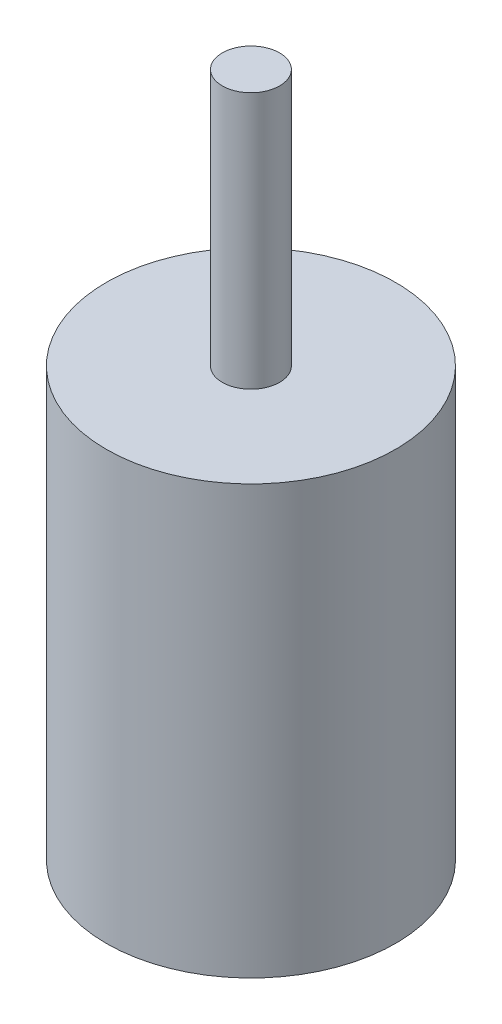
ISO-10303-21;
HEADER;
FILE_DESCRIPTION(('STEP AP214'),'2;1');
FILE_NAME('part.step','',(''),(''),'','','');
FILE_SCHEMA(('AUTOMOTIVE_DESIGN { 1 0 10303 214 1 1 1 1 }'));
ENDSEC;
DATA;
#1=APPLICATION_CONTEXT('core data for automotive mechanical design processes');
#2=APPLICATION_PROTOCOL_DEFINITION('international standard','automotive_design',2000,#1);
#3=PRODUCT_CONTEXT('',#1,'mechanical');
#4=PRODUCT('Part','Part','',(#3));
#5=PRODUCT_RELATED_PRODUCT_CATEGORY('part','',(#4));
#6=PRODUCT_DEFINITION_FORMATION('','',#4);
#7=PRODUCT_DEFINITION_CONTEXT('part definition',#1,'design');
#8=PRODUCT_DEFINITION('design','',#6,#7);
#9=PRODUCT_DEFINITION_SHAPE('','',#8);
#10=(LENGTH_UNIT() NAMED_UNIT(*) SI_UNIT(.MILLI.,.METRE.));
#11=(NAMED_UNIT(*) PLANE_ANGLE_UNIT() SI_UNIT($,.RADIAN.));
#12=(NAMED_UNIT(*) SI_UNIT($,.STERADIAN.) SOLID_ANGLE_UNIT());
#13=UNCERTAINTY_MEASURE_WITH_UNIT(LENGTH_MEASURE(1.E-05),#10,'distance_accuracy_value','');
#14=(GEOMETRIC_REPRESENTATION_CONTEXT(3) GLOBAL_UNCERTAINTY_ASSIGNED_CONTEXT((#13)) GLOBAL_UNIT_ASSIGNED_CONTEXT((#10,
#11,#12)) REPRESENTATION_CONTEXT('',''));
#15=CARTESIAN_POINT('',(0.,0.,0.));
#16=DIRECTION('',(0.,0.,1.));
#17=DIRECTION('',(1.,0.,0.));
#18=AXIS2_PLACEMENT_3D('',#15,#16,#17);
#19=CARTESIAN_POINT('',(0.,63.5,0.));
#20=DIRECTION('',(0.,-1.,0.));
#21=DIRECTION('',(0.,0.,-1.));
#22=AXIS2_PLACEMENT_3D('',#19,#20,#21);
#23=CYLINDRICAL_SURFACE('',#22,21.463);
#24=CARTESIAN_POINT('',(0.,63.5,0.));
#25=DIRECTION('',(0.,1.,0.));
#26=DIRECTION('',(0.,0.,1.));
#27=AXIS2_PLACEMENT_3D('',#24,#25,#26);
#28=CIRCLE('',#27,21.463);
#29=CARTESIAN_POINT('',(0.,63.5,21.463));
#30=VERTEX_POINT('',#29);
#31=EDGE_CURVE('E38',#30,#30,#28,.T.);
#32=ORIENTED_EDGE('',*,*,#31,.F.);
#33=EDGE_LOOP('',(#32));
#34=FACE_BOUND('',#33,.T.);
#35=CARTESIAN_POINT('',(0.,0.,0.));
#36=DIRECTION('',(0.,1.,0.));
#37=DIRECTION('',(0.,0.,1.));
#38=AXIS2_PLACEMENT_3D('',#35,#36,#37);
#39=CIRCLE('',#38,21.463);
#40=CARTESIAN_POINT('',(0.,0.,21.463));
#41=VERTEX_POINT('',#40);
#42=EDGE_CURVE('E34',#41,#41,#39,.T.);
#43=ORIENTED_EDGE('',*,*,#42,.T.);
#44=EDGE_LOOP('',(#43));
#45=FACE_BOUND('',#44,.T.);
#46=ADVANCED_FACE('F31',(#34,#45),#23,.T.);
#47=CARTESIAN_POINT('',(0.,63.5,0.));
#48=DIRECTION('',(0.,1.,0.));
#49=DIRECTION('',(0.,0.,1.));
#50=AXIS2_PLACEMENT_3D('',#47,#48,#49);
#51=PLANE('',#50);
#52=CARTESIAN_POINT('',(0.,63.5,0.));
#53=DIRECTION('',(0.,1.,0.));
#54=DIRECTION('',(0.,0.,1.));
#55=AXIS2_PLACEMENT_3D('',#52,#53,#54);
#56=CIRCLE('',#55,4.25);
#57=CARTESIAN_POINT('',(0.,63.5,4.25));
#58=VERTEX_POINT('',#57);
#59=EDGE_CURVE('E10',#58,#58,#56,.T.);
#60=ORIENTED_EDGE('',*,*,#59,.F.);
#61=EDGE_LOOP('',(#60));
#62=FACE_BOUND('',#61,.T.);
#63=ORIENTED_EDGE('',*,*,#31,.T.);
#64=EDGE_LOOP('',(#63));
#65=FACE_BOUND('',#64,.T.);
#66=ADVANCED_FACE('F55',(#62,#65),#51,.T.);
#67=CARTESIAN_POINT('',(0.,0.,0.));
#68=DIRECTION('',(0.,1.,0.));
#69=DIRECTION('',(0.,0.,1.));
#70=AXIS2_PLACEMENT_3D('',#67,#68,#69);
#71=PLANE('',#70);
#72=ORIENTED_EDGE('',*,*,#42,.F.);
#73=EDGE_LOOP('',(#72));
#74=FACE_BOUND('',#73,.T.);
#75=ADVANCED_FACE('F52',(#74),#71,.F.);
#76=CARTESIAN_POINT('',(0.,101.6,0.));
#77=DIRECTION('',(0.,-1.,0.));
#78=DIRECTION('',(0.,0.,-1.));
#79=AXIS2_PLACEMENT_3D('',#76,#77,#78);
#80=CYLINDRICAL_SURFACE('',#79,4.25);
#81=CARTESIAN_POINT('',(0.,101.6,0.));
#82=DIRECTION('',(0.,1.,0.));
#83=DIRECTION('',(0.,0.,1.));
#84=AXIS2_PLACEMENT_3D('',#81,#82,#83);
#85=CIRCLE('',#84,4.25);
#86=CARTESIAN_POINT('',(0.,101.6,4.25));
#87=VERTEX_POINT('',#86);
#88=EDGE_CURVE('E44',#87,#87,#85,.T.);
#89=ORIENTED_EDGE('',*,*,#88,.F.);
#90=EDGE_LOOP('',(#89));
#91=FACE_BOUND('',#90,.T.);
#92=ORIENTED_EDGE('',*,*,#59,.T.);
#93=EDGE_LOOP('',(#92));
#94=FACE_BOUND('',#93,.T.);
#95=ADVANCED_FACE('F54',(#91,#94),#80,.T.);
#96=CARTESIAN_POINT('',(0.,101.6,0.));
#97=DIRECTION('',(0.,1.,0.));
#98=DIRECTION('',(0.,0.,1.));
#99=AXIS2_PLACEMENT_3D('',#96,#97,#98);
#100=PLANE('',#99);
#101=ORIENTED_EDGE('',*,*,#88,.T.);
#102=EDGE_LOOP('',(#101));
#103=FACE_BOUND('',#102,.T.);
#104=ADVANCED_FACE('F60',(#103),#100,.T.);
#105=CLOSED_SHELL('',(#46,#66,#75,#95,#104));
#106=MANIFOLD_SOLID_BREP('B2',#105);
#107=ADVANCED_BREP_SHAPE_REPRESENTATION('',(#18,#106),#14);
#108=SHAPE_DEFINITION_REPRESENTATION(#9,#107);
ENDSEC;
END-ISO-10303-21;
